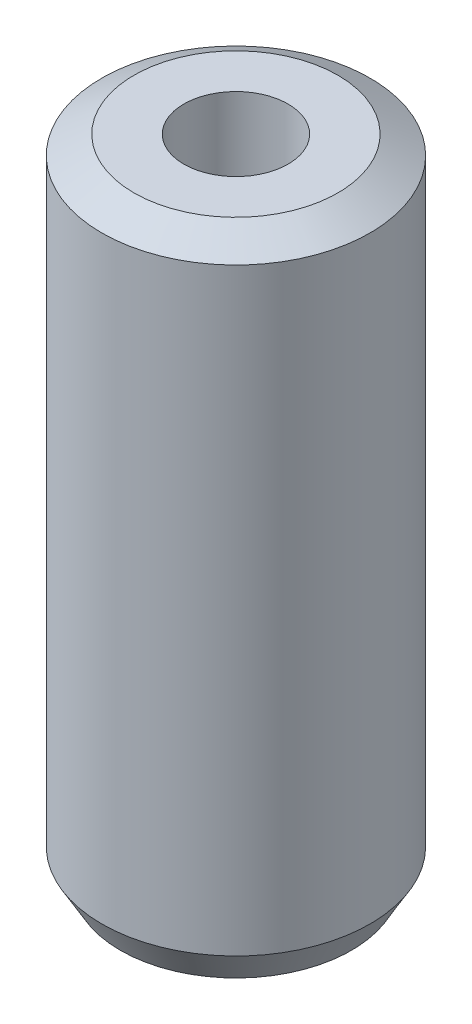
ISO-10303-21;
HEADER;
FILE_DESCRIPTION(('STEP AP214'),'2;1');
FILE_NAME('part.step','',(''),(''),'','','');
FILE_SCHEMA(('AUTOMOTIVE_DESIGN { 1 0 10303 214 1 1 1 1 }'));
ENDSEC;
DATA;
#1=APPLICATION_CONTEXT('core data for automotive mechanical design processes');
#2=APPLICATION_PROTOCOL_DEFINITION('international standard','automotive_design',2000,#1);
#3=PRODUCT_CONTEXT('',#1,'mechanical');
#4=PRODUCT('Part','Part','',(#3));
#5=PRODUCT_RELATED_PRODUCT_CATEGORY('part','',(#4));
#6=PRODUCT_DEFINITION_FORMATION('','',#4);
#7=PRODUCT_DEFINITION_CONTEXT('part definition',#1,'design');
#8=PRODUCT_DEFINITION('design','',#6,#7);
#9=PRODUCT_DEFINITION_SHAPE('','',#8);
#10=(LENGTH_UNIT() NAMED_UNIT(*) SI_UNIT(.MILLI.,.METRE.));
#11=(NAMED_UNIT(*) PLANE_ANGLE_UNIT() SI_UNIT($,.RADIAN.));
#12=(NAMED_UNIT(*) SI_UNIT($,.STERADIAN.) SOLID_ANGLE_UNIT());
#13=UNCERTAINTY_MEASURE_WITH_UNIT(LENGTH_MEASURE(1.E-05),#10,'distance_accuracy_value','');
#14=(GEOMETRIC_REPRESENTATION_CONTEXT(3) GLOBAL_UNCERTAINTY_ASSIGNED_CONTEXT((#13)) GLOBAL_UNIT_ASSIGNED_CONTEXT((#10,
#11,#12)) REPRESENTATION_CONTEXT('',''));
#15=CARTESIAN_POINT('',(0.,0.,0.));
#16=DIRECTION('',(0.,0.,1.));
#17=DIRECTION('',(1.,0.,0.));
#18=AXIS2_PLACEMENT_3D('',#15,#16,#17);
#19=CARTESIAN_POINT('',(0.,205.681038497357,0.));
#20=DIRECTION('',(0.,-1.,0.));
#21=DIRECTION('',(0.,0.,-1.));
#22=AXIS2_PLACEMENT_3D('',#19,#20,#21);
#23=CYLINDRICAL_SURFACE('',#22,42.5);
#24=CARTESIAN_POINT('',(0.,199.79543329035,0.));
#25=DIRECTION('',(0.,1.,0.));
#26=DIRECTION('',(0.,0.,1.));
#27=AXIS2_PLACEMENT_3D('',#24,#25,#26);
#28=CIRCLE('',#27,42.5);
#29=CARTESIAN_POINT('',(0.,199.79543329035,42.5));
#30=VERTEX_POINT('',#29);
#31=EDGE_CURVE('E50',#30,#30,#28,.F.);
#32=ORIENTED_EDGE('',*,*,#31,.T.);
#33=EDGE_LOOP('',(#32));
#34=FACE_BOUND('',#33,.T.);
#35=CARTESIAN_POINT('',(0.,10.194167251829,0.));
#36=DIRECTION('',(0.,1.,0.));
#37=DIRECTION('',(0.,0.,1.));
#38=AXIS2_PLACEMENT_3D('',#35,#36,#37);
#39=CIRCLE('',#38,42.5);
#40=CARTESIAN_POINT('',(0.,10.194167251829,42.5));
#41=VERTEX_POINT('',#40);
#42=EDGE_CURVE('E51',#41,#41,#39,.T.);
#43=ORIENTED_EDGE('',*,*,#42,.T.);
#44=EDGE_LOOP('',(#43));
#45=FACE_BOUND('',#44,.T.);
#46=ADVANCED_FACE('F39',(#34,#45),#23,.T.);
#47=CARTESIAN_POINT('',(0.,205.681038497357,0.));
#48=DIRECTION('',(0.,1.,0.));
#49=DIRECTION('',(0.,0.,1.));
#50=AXIS2_PLACEMENT_3D('',#47,#48,#49);
#51=PLANE('',#50);
#52=CARTESIAN_POINT('',(0.,205.681038497357,0.));
#53=DIRECTION('',(0.,1.,0.));
#54=DIRECTION('',(0.,0.,1.));
#55=AXIS2_PLACEMENT_3D('',#52,#53,#54);
#56=CIRCLE('',#55,32.305832748171);
#57=CARTESIAN_POINT('',(0.,205.681038497357,32.305832748171));
#58=VERTEX_POINT('',#57);
#59=EDGE_CURVE('E54',#58,#58,#56,.T.);
#60=ORIENTED_EDGE('',*,*,#59,.T.);
#61=EDGE_LOOP('',(#60));
#62=FACE_BOUND('',#61,.T.);
#63=CARTESIAN_POINT('',(0.,205.681038497357,0.));
#64=DIRECTION('',(0.,1.,0.));
#65=DIRECTION('',(0.,0.,1.));
#66=AXIS2_PLACEMENT_3D('',#63,#64,#65);
#67=CIRCLE('',#66,16.5150789690393);
#68=CARTESIAN_POINT('',(0.,205.681038497357,16.5150789690393));
#69=VERTEX_POINT('',#68);
#70=EDGE_CURVE('E58',#69,#69,#67,.T.);
#71=ORIENTED_EDGE('',*,*,#70,.F.);
#72=EDGE_LOOP('',(#71));
#73=FACE_BOUND('',#72,.T.);
#74=ADVANCED_FACE('F69',(#62,#73),#51,.T.);
#75=CARTESIAN_POINT('',(0.,0.,0.));
#76=DIRECTION('',(0.,1.,0.));
#77=DIRECTION('',(0.,0.,1.));
#78=AXIS2_PLACEMENT_3D('',#75,#76,#77);
#79=PLANE('',#78);
#80=CARTESIAN_POINT('',(0.,0.,0.));
#81=DIRECTION('',(0.,1.,0.));
#82=DIRECTION('',(0.,0.,1.));
#83=AXIS2_PLACEMENT_3D('',#80,#81,#82);
#84=CIRCLE('',#83,36.6143947929924);
#85=CARTESIAN_POINT('',(0.,0.,36.6143947929924));
#86=VERTEX_POINT('',#85);
#87=EDGE_CURVE('E10',#86,#86,#84,.F.);
#88=ORIENTED_EDGE('',*,*,#87,.T.);
#89=EDGE_LOOP('',(#88));
#90=FACE_BOUND('',#89,.T.);
#91=CARTESIAN_POINT('',(0.,0.,0.));
#92=DIRECTION('',(0.,1.,0.));
#93=DIRECTION('',(0.,0.,1.));
#94=AXIS2_PLACEMENT_3D('',#91,#92,#93);
#95=CIRCLE('',#94,16.5150789690393);
#96=CARTESIAN_POINT('',(0.,0.,16.5150789690393));
#97=VERTEX_POINT('',#96);
#98=EDGE_CURVE('E63',#97,#97,#95,.T.);
#99=ORIENTED_EDGE('',*,*,#98,.T.);
#100=EDGE_LOOP('',(#99));
#101=FACE_BOUND('',#100,.T.);
#102=ADVANCED_FACE('F75',(#90,#101),#79,.F.);
#103=CARTESIAN_POINT('',(0.,205.681038497357,0.));
#104=DIRECTION('',(0.,-1.,0.));
#105=DIRECTION('',(0.,0.,-1.));
#106=AXIS2_PLACEMENT_3D('',#103,#104,#105);
#107=CYLINDRICAL_SURFACE('',#106,16.5150789690393);
#108=ORIENTED_EDGE('',*,*,#70,.T.);
#109=EDGE_LOOP('',(#108));
#110=FACE_BOUND('',#109,.T.);
#111=ORIENTED_EDGE('',*,*,#98,.F.);
#112=EDGE_LOOP('',(#111));
#113=FACE_BOUND('',#112,.T.);
#114=ADVANCED_FACE('F70',(#110,#113),#107,.F.);
#115=CARTESIAN_POINT('',(0.,205.681038497357,0.));
#116=DIRECTION('',(0.,-1.,0.));
#117=DIRECTION('',(0.,0.,-1.));
#118=AXIS2_PLACEMENT_3D('',#115,#116,#117);
#119=CONICAL_SURFACE('',#118,32.305832748171,1.04719755119659);
#120=ORIENTED_EDGE('',*,*,#31,.F.);
#121=EDGE_LOOP('',(#120));
#122=FACE_BOUND('',#121,.T.);
#123=ORIENTED_EDGE('',*,*,#59,.F.);
#124=EDGE_LOOP('',(#123));
#125=FACE_BOUND('',#124,.T.);
#126=ADVANCED_FACE('F81',(#122,#125),#119,.T.);
#127=CARTESIAN_POINT('',(0.,10.194167251829,0.));
#128=DIRECTION('',(0.,1.,0.));
#129=DIRECTION('',(0.,0.,1.));
#130=AXIS2_PLACEMENT_3D('',#127,#128,#129);
#131=CONICAL_SURFACE('',#130,42.5,0.523598775598303);
#132=ORIENTED_EDGE('',*,*,#87,.F.);
#133=EDGE_LOOP('',(#132));
#134=FACE_BOUND('',#133,.T.);
#135=ORIENTED_EDGE('',*,*,#42,.F.);
#136=EDGE_LOOP('',(#135));
#137=FACE_BOUND('',#136,.T.);
#138=ADVANCED_FACE('F45',(#134,#137),#131,.T.);
#139=CLOSED_SHELL('',(#46,#74,#102,#114,#126,#138));
#140=MANIFOLD_SOLID_BREP('B2',#139);
#141=ADVANCED_BREP_SHAPE_REPRESENTATION('',(#18,#140),#14);
#142=SHAPE_DEFINITION_REPRESENTATION(#9,#141);
ENDSEC;
END-ISO-10303-21;
